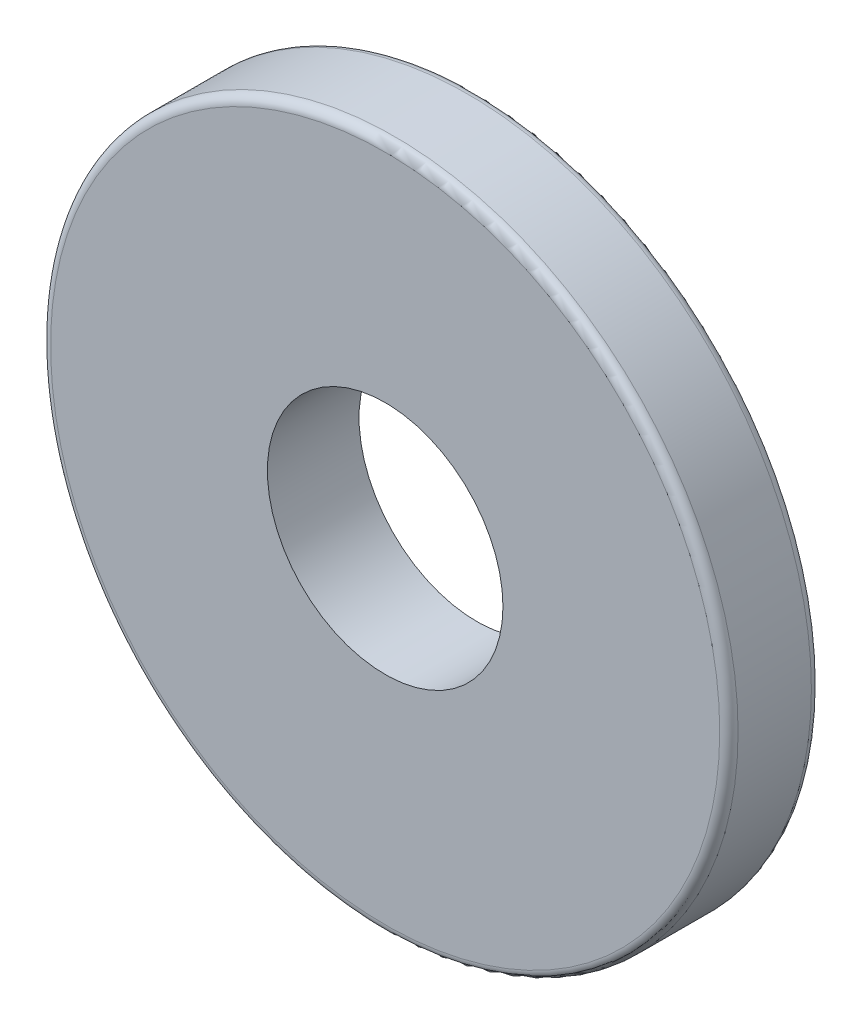
ISO-10303-21;
HEADER;
FILE_DESCRIPTION(('STEP AP214'),'2;1');
FILE_NAME('part.step','',(''),(''),'','','');
FILE_SCHEMA(('AUTOMOTIVE_DESIGN { 1 0 10303 214 1 1 1 1 }'));
ENDSEC;
DATA;
#1=APPLICATION_CONTEXT('core data for automotive mechanical design processes');
#2=APPLICATION_PROTOCOL_DEFINITION('international standard','automotive_design',2000,#1);
#3=PRODUCT_CONTEXT('',#1,'mechanical');
#4=PRODUCT('Part','Part','',(#3));
#5=PRODUCT_RELATED_PRODUCT_CATEGORY('part','',(#4));
#6=PRODUCT_DEFINITION_FORMATION('','',#4);
#7=PRODUCT_DEFINITION_CONTEXT('part definition',#1,'design');
#8=PRODUCT_DEFINITION('design','',#6,#7);
#9=PRODUCT_DEFINITION_SHAPE('','',#8);
#10=(LENGTH_UNIT() NAMED_UNIT(*) SI_UNIT(.MILLI.,.METRE.));
#11=(NAMED_UNIT(*) PLANE_ANGLE_UNIT() SI_UNIT($,.RADIAN.));
#12=(NAMED_UNIT(*) SI_UNIT($,.STERADIAN.) SOLID_ANGLE_UNIT());
#13=UNCERTAINTY_MEASURE_WITH_UNIT(LENGTH_MEASURE(1.E-05),#10,'distance_accuracy_value','');
#14=(GEOMETRIC_REPRESENTATION_CONTEXT(3) GLOBAL_UNCERTAINTY_ASSIGNED_CONTEXT((#13)) GLOBAL_UNIT_ASSIGNED_CONTEXT((#10,
#11,#12)) REPRESENTATION_CONTEXT('',''));
#15=CARTESIAN_POINT('',(0.,0.,0.));
#16=DIRECTION('',(0.,0.,1.));
#17=DIRECTION('',(1.,0.,0.));
#18=AXIS2_PLACEMENT_3D('',#15,#16,#17);
#19=CARTESIAN_POINT('',(0.,0.,2.54));
#20=DIRECTION('',(0.,0.,1.));
#21=DIRECTION('',(1.,0.,0.));
#22=AXIS2_PLACEMENT_3D('',#19,#20,#21);
#23=PLANE('',#22);
#24=CARTESIAN_POINT('',(0.,0.,2.54));
#25=DIRECTION('',(0.,0.,1.));
#26=DIRECTION('',(1.,0.,0.));
#27=AXIS2_PLACEMENT_3D('',#24,#25,#26);
#28=CIRCLE('',#27,9.271);
#29=CARTESIAN_POINT('',(9.271,0.,2.54));
#30=VERTEX_POINT('',#29);
#31=EDGE_CURVE('E10',#30,#30,#28,.T.);
#32=ORIENTED_EDGE('',*,*,#31,.T.);
#33=EDGE_LOOP('',(#32));
#34=FACE_BOUND('',#33,.T.);
#35=CARTESIAN_POINT('',(0.,0.,2.54));
#36=DIRECTION('',(0.,0.,1.));
#37=DIRECTION('',(1.,0.,0.));
#38=AXIS2_PLACEMENT_3D('',#35,#36,#37);
#39=CIRCLE('',#38,3.2639);
#40=CARTESIAN_POINT('',(3.2639,0.,2.54));
#41=VERTEX_POINT('',#40);
#42=EDGE_CURVE('E51',#41,#41,#39,.T.);
#43=ORIENTED_EDGE('',*,*,#42,.F.);
#44=EDGE_LOOP('',(#43));
#45=FACE_BOUND('',#44,.T.);
#46=ADVANCED_FACE('F31',(#34,#45),#23,.T.);
#47=CARTESIAN_POINT('',(0.,0.,0.));
#48=DIRECTION('',(0.,0.,1.));
#49=DIRECTION('',(1.,0.,0.));
#50=AXIS2_PLACEMENT_3D('',#47,#48,#49);
#51=PLANE('',#50);
#52=CARTESIAN_POINT('',(0.,0.,0.));
#53=DIRECTION('',(0.,0.,1.));
#54=DIRECTION('',(1.,0.,0.));
#55=AXIS2_PLACEMENT_3D('',#52,#53,#54);
#56=CIRCLE('',#55,9.271);
#57=CARTESIAN_POINT('',(9.271,0.,0.));
#58=VERTEX_POINT('',#57);
#59=EDGE_CURVE('E38',#58,#58,#56,.F.);
#60=ORIENTED_EDGE('',*,*,#59,.T.);
#61=EDGE_LOOP('',(#60));
#62=FACE_BOUND('',#61,.T.);
#63=CARTESIAN_POINT('',(0.,0.,0.));
#64=DIRECTION('',(0.,0.,1.));
#65=DIRECTION('',(1.,0.,0.));
#66=AXIS2_PLACEMENT_3D('',#63,#64,#65);
#67=CIRCLE('',#66,3.2639);
#68=CARTESIAN_POINT('',(3.2639,0.,0.));
#69=VERTEX_POINT('',#68);
#70=EDGE_CURVE('E52',#69,#69,#67,.T.);
#71=ORIENTED_EDGE('',*,*,#70,.T.);
#72=EDGE_LOOP('',(#71));
#73=FACE_BOUND('',#72,.T.);
#74=ADVANCED_FACE('F62',(#62,#73),#51,.F.);
#75=CARTESIAN_POINT('',(0.,0.,2.54));
#76=DIRECTION('',(0.,0.,-1.));
#77=DIRECTION('',(-1.,0.,0.));
#78=AXIS2_PLACEMENT_3D('',#75,#76,#77);
#79=CYLINDRICAL_SURFACE('',#78,9.525);
#80=CARTESIAN_POINT('',(0.,0.,0.254));
#81=DIRECTION('',(0.,0.,1.));
#82=DIRECTION('',(1.,0.,0.));
#83=AXIS2_PLACEMENT_3D('',#80,#81,#82);
#84=CIRCLE('',#83,9.525);
#85=CARTESIAN_POINT('',(9.525,0.,0.254));
#86=VERTEX_POINT('',#85);
#87=EDGE_CURVE('E42',#86,#86,#84,.T.);
#88=ORIENTED_EDGE('',*,*,#87,.T.);
#89=EDGE_LOOP('',(#88));
#90=FACE_BOUND('',#89,.T.);
#91=CARTESIAN_POINT('',(0.,0.,2.286));
#92=DIRECTION('',(0.,0.,1.));
#93=DIRECTION('',(1.,0.,0.));
#94=AXIS2_PLACEMENT_3D('',#91,#92,#93);
#95=CIRCLE('',#94,9.525);
#96=CARTESIAN_POINT('',(9.525,0.,2.286));
#97=VERTEX_POINT('',#96);
#98=EDGE_CURVE('E46',#97,#97,#95,.F.);
#99=ORIENTED_EDGE('',*,*,#98,.T.);
#100=EDGE_LOOP('',(#99));
#101=FACE_BOUND('',#100,.T.);
#102=ADVANCED_FACE('F67',(#90,#101),#79,.T.);
#103=CARTESIAN_POINT('',(0.,0.,2.54));
#104=DIRECTION('',(0.,0.,-1.));
#105=DIRECTION('',(-1.,0.,0.));
#106=AXIS2_PLACEMENT_3D('',#103,#104,#105);
#107=CYLINDRICAL_SURFACE('',#106,3.2639);
#108=ORIENTED_EDGE('',*,*,#42,.T.);
#109=EDGE_LOOP('',(#108));
#110=FACE_BOUND('',#109,.T.);
#111=ORIENTED_EDGE('',*,*,#70,.F.);
#112=EDGE_LOOP('',(#111));
#113=FACE_BOUND('',#112,.T.);
#114=ADVANCED_FACE('F58',(#110,#113),#107,.F.);
#115=CARTESIAN_POINT('',(0.,0.,0.254));
#116=DIRECTION('',(0.,0.,1.));
#117=DIRECTION('',(1.,0.,0.));
#118=AXIS2_PLACEMENT_3D('',#115,#116,#117);
#119=TOROIDAL_SURFACE('',#118,9.271,0.254);
#120=ORIENTED_EDGE('',*,*,#59,.F.);
#121=EDGE_LOOP('',(#120));
#122=FACE_BOUND('',#121,.T.);
#123=ORIENTED_EDGE('',*,*,#87,.F.);
#124=EDGE_LOOP('',(#123));
#125=FACE_BOUND('',#124,.T.);
#126=ADVANCED_FACE('F73',(#122,#125),#119,.T.);
#127=CARTESIAN_POINT('',(0.,0.,2.286));
#128=DIRECTION('',(0.,0.,1.));
#129=DIRECTION('',(1.,0.,0.));
#130=AXIS2_PLACEMENT_3D('',#127,#128,#129);
#131=TOROIDAL_SURFACE('',#130,9.271,0.254);
#132=ORIENTED_EDGE('',*,*,#98,.F.);
#133=EDGE_LOOP('',(#132));
#134=FACE_BOUND('',#133,.T.);
#135=ORIENTED_EDGE('',*,*,#31,.F.);
#136=EDGE_LOOP('',(#135));
#137=FACE_BOUND('',#136,.T.);
#138=ADVANCED_FACE('F33',(#134,#137),#131,.T.);
#139=CLOSED_SHELL('',(#46,#74,#102,#114,#126,#138));
#140=MANIFOLD_SOLID_BREP('B2',#139);
#141=ADVANCED_BREP_SHAPE_REPRESENTATION('',(#18,#140),#14);
#142=SHAPE_DEFINITION_REPRESENTATION(#9,#141);
ENDSEC;
END-ISO-10303-21;
